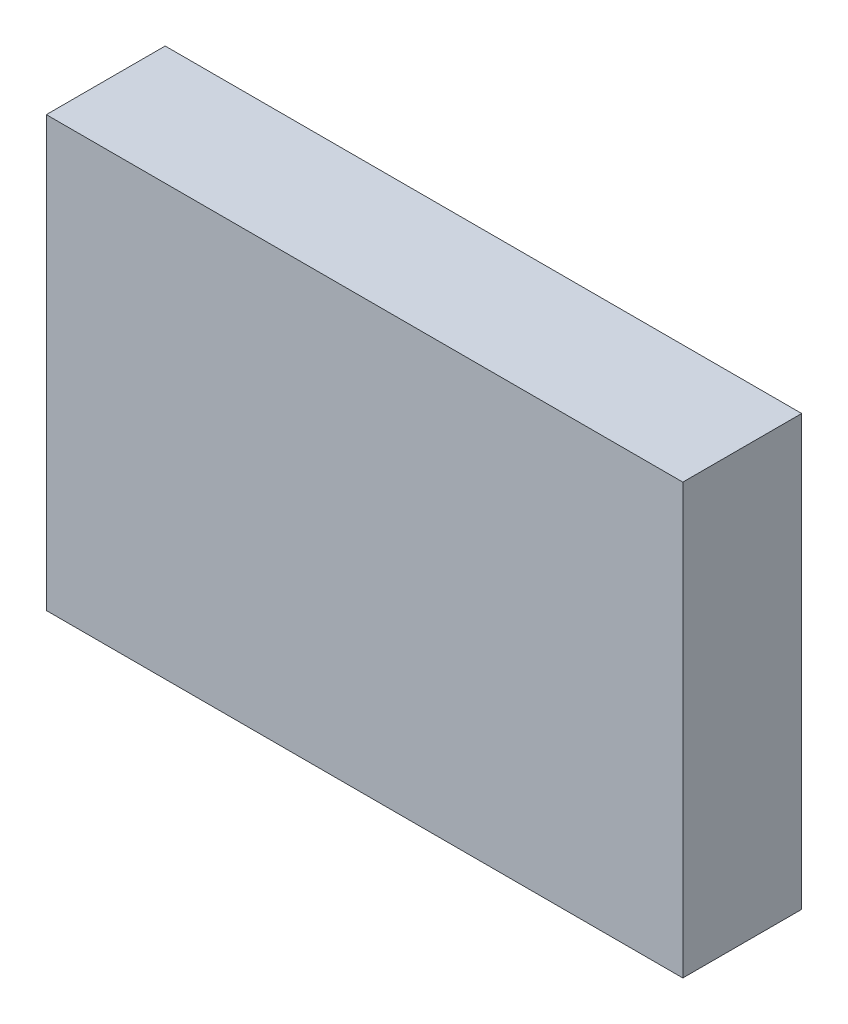
ISO-10303-21;
HEADER;
FILE_DESCRIPTION(('STEP AP214'),'2;1');
FILE_NAME('part.step','',(''),(''),'','','');
FILE_SCHEMA(('AUTOMOTIVE_DESIGN { 1 0 10303 214 1 1 1 1 }'));
ENDSEC;
DATA;
#1=APPLICATION_CONTEXT('core data for automotive mechanical design processes');
#2=APPLICATION_PROTOCOL_DEFINITION('international standard','automotive_design',2000,#1);
#3=PRODUCT_CONTEXT('',#1,'mechanical');
#4=PRODUCT('Part','Part','',(#3));
#5=PRODUCT_RELATED_PRODUCT_CATEGORY('part','',(#4));
#6=PRODUCT_DEFINITION_FORMATION('','',#4);
#7=PRODUCT_DEFINITION_CONTEXT('part definition',#1,'design');
#8=PRODUCT_DEFINITION('design','',#6,#7);
#9=PRODUCT_DEFINITION_SHAPE('','',#8);
#10=(LENGTH_UNIT() NAMED_UNIT(*) SI_UNIT(.MILLI.,.METRE.));
#11=(NAMED_UNIT(*) PLANE_ANGLE_UNIT() SI_UNIT($,.RADIAN.));
#12=(NAMED_UNIT(*) SI_UNIT($,.STERADIAN.) SOLID_ANGLE_UNIT());
#13=UNCERTAINTY_MEASURE_WITH_UNIT(LENGTH_MEASURE(1.E-05),#10,'distance_accuracy_value','');
#14=(GEOMETRIC_REPRESENTATION_CONTEXT(3) GLOBAL_UNCERTAINTY_ASSIGNED_CONTEXT((#13)) GLOBAL_UNIT_ASSIGNED_CONTEXT((#10,
#11,#12)) REPRESENTATION_CONTEXT('',''));
#15=CARTESIAN_POINT('',(0.,0.,0.));
#16=DIRECTION('',(0.,0.,1.));
#17=DIRECTION('',(1.,0.,0.));
#18=AXIS2_PLACEMENT_3D('',#15,#16,#17);
#19=CARTESIAN_POINT('',(-4.14999932,-2.79999948,1.54999944));
#20=DIRECTION('',(0.,0.,-1.));
#21=DIRECTION('',(-1.,0.,0.));
#22=AXIS2_PLACEMENT_3D('',#19,#20,#21);
#23=PLANE('',#22);
#24=DIRECTION('',(0.,1.,0.));
#25=VECTOR('',#24,1.);
#26=CARTESIAN_POINT('',(4.15000186,-2.79999948,1.54999944));
#27=LINE('',#26,#25);
#28=CARTESIAN_POINT('',(4.15000186,-2.79999948,1.54999944));
#29=VERTEX_POINT('',#28);
#30=CARTESIAN_POINT('',(4.15000186,2.79999948,1.54999944));
#31=VERTEX_POINT('',#30);
#32=EDGE_CURVE('E55',#29,#31,#27,.T.);
#33=ORIENTED_EDGE('',*,*,#32,.T.);
#34=DIRECTION('',(1.,0.,0.));
#35=VECTOR('',#34,1.);
#36=CARTESIAN_POINT('',(4.15000186,2.79999948,1.54999944));
#37=LINE('',#36,#35);
#38=CARTESIAN_POINT('',(-4.14999932,2.79999948,1.54999944));
#39=VERTEX_POINT('',#38);
#40=EDGE_CURVE('E57',#31,#39,#37,.F.);
#41=ORIENTED_EDGE('',*,*,#40,.T.);
#42=DIRECTION('',(0.,1.,0.));
#43=VECTOR('',#42,1.);
#44=CARTESIAN_POINT('',(-4.14999932,2.79999948,1.54999944));
#45=LINE('',#44,#43);
#46=CARTESIAN_POINT('',(-4.14999932,-2.79999948,1.54999944));
#47=VERTEX_POINT('',#46);
#48=EDGE_CURVE('E20',#39,#47,#45,.F.);
#49=ORIENTED_EDGE('',*,*,#48,.T.);
#50=DIRECTION('',(1.,0.,0.));
#51=VECTOR('',#50,1.);
#52=CARTESIAN_POINT('',(-4.14999932,-2.79999948,1.54999944));
#53=LINE('',#52,#51);
#54=EDGE_CURVE('E80',#47,#29,#53,.T.);
#55=ORIENTED_EDGE('',*,*,#54,.T.);
#56=EDGE_LOOP('',(#33,#41,#49,#55));
#57=FACE_BOUND('',#56,.T.);
#58=ADVANCED_FACE('F17',(#57),#23,.F.);
#59=CARTESIAN_POINT('',(-4.14999932,2.79999948,0.));
#60=DIRECTION('',(1.,0.,0.));
#61=DIRECTION('',(0.,0.,-1.));
#62=AXIS2_PLACEMENT_3D('',#59,#60,#61);
#63=PLANE('',#62);
#64=DIRECTION('',(0.,0.,1.));
#65=VECTOR('',#64,1.);
#66=CARTESIAN_POINT('',(-4.14999932,-2.79999948,0.));
#67=LINE('',#66,#65);
#68=CARTESIAN_POINT('',(-4.14999932,-2.79999948,0.));
#69=VERTEX_POINT('',#68);
#70=EDGE_CURVE('E68',#69,#47,#67,.T.);
#71=ORIENTED_EDGE('',*,*,#70,.T.);
#72=ORIENTED_EDGE('',*,*,#48,.F.);
#73=DIRECTION('',(0.,0.,-1.));
#74=VECTOR('',#73,1.);
#75=CARTESIAN_POINT('',(-4.14999932,2.79999948,0.));
#76=LINE('',#75,#74);
#77=CARTESIAN_POINT('',(-4.14999932,2.79999948,0.));
#78=VERTEX_POINT('',#77);
#79=EDGE_CURVE('E63',#39,#78,#76,.T.);
#80=ORIENTED_EDGE('',*,*,#79,.T.);
#81=DIRECTION('',(0.,1.,0.));
#82=VECTOR('',#81,1.);
#83=CARTESIAN_POINT('',(-4.14999932,-2.79999948,0.));
#84=LINE('',#83,#82);
#85=EDGE_CURVE('E83',#69,#78,#84,.T.);
#86=ORIENTED_EDGE('',*,*,#85,.F.);
#87=EDGE_LOOP('',(#71,#72,#80,#86));
#88=FACE_BOUND('',#87,.T.);
#89=ADVANCED_FACE('F65',(#88),#63,.F.);
#90=CARTESIAN_POINT('',(4.15000186,2.79999948,0.));
#91=DIRECTION('',(0.,-1.,0.));
#92=DIRECTION('',(0.,0.,-1.));
#93=AXIS2_PLACEMENT_3D('',#90,#91,#92);
#94=PLANE('',#93);
#95=ORIENTED_EDGE('',*,*,#79,.F.);
#96=ORIENTED_EDGE('',*,*,#40,.F.);
#97=DIRECTION('',(0.,0.,1.));
#98=VECTOR('',#97,1.);
#99=CARTESIAN_POINT('',(4.15000186,2.79999948,0.));
#100=LINE('',#99,#98);
#101=CARTESIAN_POINT('',(4.15000186,2.79999948,0.));
#102=VERTEX_POINT('',#101);
#103=EDGE_CURVE('E75',#31,#102,#100,.F.);
#104=ORIENTED_EDGE('',*,*,#103,.T.);
#105=DIRECTION('',(-1.,0.,0.));
#106=VECTOR('',#105,1.);
#107=CARTESIAN_POINT('',(-4.14999932,2.79999948,0.));
#108=LINE('',#107,#106);
#109=EDGE_CURVE('E72',#78,#102,#108,.F.);
#110=ORIENTED_EDGE('',*,*,#109,.F.);
#111=EDGE_LOOP('',(#95,#96,#104,#110));
#112=FACE_BOUND('',#111,.T.);
#113=ADVANCED_FACE('F70',(#112),#94,.F.);
#114=CARTESIAN_POINT('',(4.15000186,-2.79999948,0.));
#115=DIRECTION('',(-1.,0.,0.));
#116=DIRECTION('',(0.,0.,1.));
#117=AXIS2_PLACEMENT_3D('',#114,#115,#116);
#118=PLANE('',#117);
#119=ORIENTED_EDGE('',*,*,#103,.F.);
#120=ORIENTED_EDGE('',*,*,#32,.F.);
#121=DIRECTION('',(0.,0.,1.));
#122=VECTOR('',#121,1.);
#123=CARTESIAN_POINT('',(4.15000186,-2.79999948,0.));
#124=LINE('',#123,#122);
#125=CARTESIAN_POINT('',(4.15000186,-2.79999948,0.));
#126=VERTEX_POINT('',#125);
#127=EDGE_CURVE('E35',#29,#126,#124,.F.);
#128=ORIENTED_EDGE('',*,*,#127,.T.);
#129=DIRECTION('',(0.,1.,0.));
#130=VECTOR('',#129,1.);
#131=CARTESIAN_POINT('',(4.15000186,-2.79999948,0.));
#132=LINE('',#131,#130);
#133=EDGE_CURVE('E26',#102,#126,#132,.F.);
#134=ORIENTED_EDGE('',*,*,#133,.F.);
#135=EDGE_LOOP('',(#119,#120,#128,#134));
#136=FACE_BOUND('',#135,.T.);
#137=ADVANCED_FACE('F89',(#136),#118,.F.);
#138=CARTESIAN_POINT('',(-4.14999932,-2.79999948,0.));
#139=DIRECTION('',(0.,1.,0.));
#140=DIRECTION('',(0.,0.,1.));
#141=AXIS2_PLACEMENT_3D('',#138,#139,#140);
#142=PLANE('',#141);
#143=ORIENTED_EDGE('',*,*,#127,.F.);
#144=ORIENTED_EDGE('',*,*,#54,.F.);
#145=ORIENTED_EDGE('',*,*,#70,.F.);
#146=DIRECTION('',(-1.,0.,0.));
#147=VECTOR('',#146,1.);
#148=CARTESIAN_POINT('',(-4.14999932,-2.79999948,0.));
#149=LINE('',#148,#147);
#150=EDGE_CURVE('E11',#126,#69,#149,.T.);
#151=ORIENTED_EDGE('',*,*,#150,.F.);
#152=EDGE_LOOP('',(#143,#144,#145,#151));
#153=FACE_BOUND('',#152,.T.);
#154=ADVANCED_FACE('F91',(#153),#142,.F.);
#155=CARTESIAN_POINT('',(-4.14999932,-2.79999948,0.));
#156=DIRECTION('',(0.,0.,-1.));
#157=DIRECTION('',(-1.,0.,0.));
#158=AXIS2_PLACEMENT_3D('',#155,#156,#157);
#159=PLANE('',#158);
#160=ORIENTED_EDGE('',*,*,#133,.T.);
#161=ORIENTED_EDGE('',*,*,#150,.T.);
#162=ORIENTED_EDGE('',*,*,#85,.T.);
#163=ORIENTED_EDGE('',*,*,#109,.T.);
#164=EDGE_LOOP('',(#160,#161,#162,#163));
#165=FACE_BOUND('',#164,.T.);
#166=ADVANCED_FACE('F88',(#165),#159,.T.);
#167=CLOSED_SHELL('',(#58,#89,#113,#137,#154,#166));
#168=MANIFOLD_SOLID_BREP('B1',#167);
#169=ADVANCED_BREP_SHAPE_REPRESENTATION('',(#18,#168),#14);
#170=SHAPE_DEFINITION_REPRESENTATION(#9,#169);
ENDSEC;
END-ISO-10303-21;
